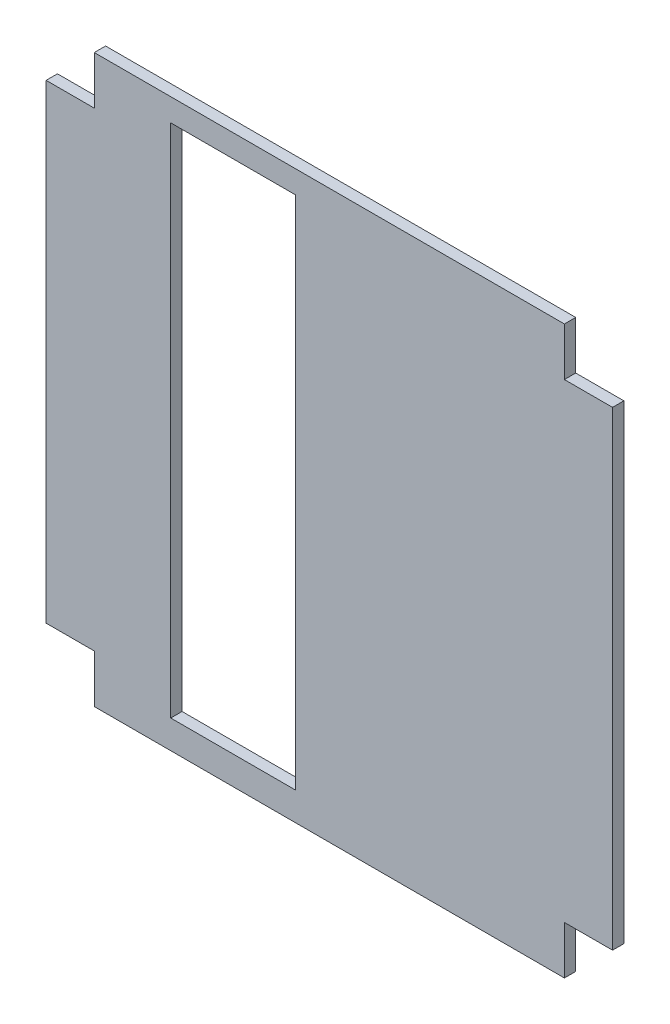
ISO-10303-21;
HEADER;
FILE_DESCRIPTION(('STEP AP214'),'2;1');
FILE_NAME('part.step','',(''),(''),'','','');
FILE_SCHEMA(('AUTOMOTIVE_DESIGN { 1 0 10303 214 1 1 1 1 }'));
ENDSEC;
DATA;
#1=APPLICATION_CONTEXT('core data for automotive mechanical design processes');
#2=APPLICATION_PROTOCOL_DEFINITION('international standard','automotive_design',2000,#1);
#3=PRODUCT_CONTEXT('',#1,'mechanical');
#4=PRODUCT('Part','Part','',(#3));
#5=PRODUCT_RELATED_PRODUCT_CATEGORY('part','',(#4));
#6=PRODUCT_DEFINITION_FORMATION('','',#4);
#7=PRODUCT_DEFINITION_CONTEXT('part definition',#1,'design');
#8=PRODUCT_DEFINITION('design','',#6,#7);
#9=PRODUCT_DEFINITION_SHAPE('','',#8);
#10=(LENGTH_UNIT() NAMED_UNIT(*) SI_UNIT(.MILLI.,.METRE.));
#11=(NAMED_UNIT(*) PLANE_ANGLE_UNIT() SI_UNIT($,.RADIAN.));
#12=(NAMED_UNIT(*) SI_UNIT($,.STERADIAN.) SOLID_ANGLE_UNIT());
#13=UNCERTAINTY_MEASURE_WITH_UNIT(LENGTH_MEASURE(1.E-05),#10,'distance_accuracy_value','');
#14=(GEOMETRIC_REPRESENTATION_CONTEXT(3) GLOBAL_UNCERTAINTY_ASSIGNED_CONTEXT((#13)) GLOBAL_UNIT_ASSIGNED_CONTEXT((#10,
#11,#12)) REPRESENTATION_CONTEXT('',''));
#15=CARTESIAN_POINT('',(0.,0.,0.));
#16=DIRECTION('',(0.,0.,1.));
#17=DIRECTION('',(1.,0.,0.));
#18=AXIS2_PLACEMENT_3D('',#15,#16,#17);
#19=CARTESIAN_POINT('',(0.,0.,2.));
#20=DIRECTION('',(0.,0.,1.));
#21=DIRECTION('',(1.,0.,0.));
#22=AXIS2_PLACEMENT_3D('',#19,#20,#21);
#23=PLANE('',#22);
#24=DIRECTION('',(1.,0.,0.));
#25=VECTOR('',#24,1.);
#26=CARTESIAN_POINT('',(-99.,90.5,2.));
#27=LINE('',#26,#25);
#28=CARTESIAN_POINT('',(-99.,90.5,2.));
#29=VERTEX_POINT('',#28);
#30=CARTESIAN_POINT('',(-90.5,90.5,2.));
#31=VERTEX_POINT('',#30);
#32=EDGE_CURVE('E187',#29,#31,#27,.T.);
#33=ORIENTED_EDGE('',*,*,#32,.F.);
#34=DIRECTION('',(0.,-1.,0.));
#35=VECTOR('',#34,1.);
#36=CARTESIAN_POINT('',(-99.,90.5,2.));
#37=LINE('',#36,#35);
#38=CARTESIAN_POINT('',(-99.,7.5,2.));
#39=VERTEX_POINT('',#38);
#40=EDGE_CURVE('E219',#29,#39,#37,.T.);
#41=ORIENTED_EDGE('',*,*,#40,.T.);
#42=DIRECTION('',(-1.,0.,0.));
#43=VECTOR('',#42,1.);
#44=CARTESIAN_POINT('',(-90.5,7.5,2.));
#45=LINE('',#44,#43);
#46=CARTESIAN_POINT('',(-90.5,7.5,2.));
#47=VERTEX_POINT('',#46);
#48=EDGE_CURVE('E216',#47,#39,#45,.T.);
#49=ORIENTED_EDGE('',*,*,#48,.F.);
#50=DIRECTION('',(0.,1.,0.));
#51=VECTOR('',#50,1.);
#52=CARTESIAN_POINT('',(-90.5,-1.,2.));
#53=LINE('',#52,#51);
#54=CARTESIAN_POINT('',(-90.5,-1.,2.));
#55=VERTEX_POINT('',#54);
#56=EDGE_CURVE('E213',#55,#47,#53,.T.);
#57=ORIENTED_EDGE('',*,*,#56,.F.);
#58=DIRECTION('',(1.,0.,0.));
#59=VECTOR('',#58,1.);
#60=CARTESIAN_POINT('',(-90.5,-1.,2.));
#61=LINE('',#60,#59);
#62=CARTESIAN_POINT('',(-7.49999999999998,-1.,2.));
#63=VERTEX_POINT('',#62);
#64=EDGE_CURVE('E211',#55,#63,#61,.T.);
#65=ORIENTED_EDGE('',*,*,#64,.T.);
#66=DIRECTION('',(0.,-1.,0.));
#67=VECTOR('',#66,1.);
#68=CARTESIAN_POINT('',(-7.49999999999999,7.5,2.));
#69=LINE('',#68,#67);
#70=CARTESIAN_POINT('',(-7.49999999999999,7.5,2.));
#71=VERTEX_POINT('',#70);
#72=EDGE_CURVE('E208',#71,#63,#69,.T.);
#73=ORIENTED_EDGE('',*,*,#72,.F.);
#74=DIRECTION('',(-1.,0.,0.));
#75=VECTOR('',#74,1.);
#76=CARTESIAN_POINT('',(1.00000000000001,7.5,2.));
#77=LINE('',#76,#75);
#78=CARTESIAN_POINT('',(1.00000000000001,7.5,2.));
#79=VERTEX_POINT('',#78);
#80=EDGE_CURVE('E205',#79,#71,#77,.T.);
#81=ORIENTED_EDGE('',*,*,#80,.F.);
#82=DIRECTION('',(0.,-1.,0.));
#83=VECTOR('',#82,1.);
#84=CARTESIAN_POINT('',(0.999999999999946,90.4999999999999,2.));
#85=LINE('',#84,#83);
#86=CARTESIAN_POINT('',(0.999999999999946,90.4999999999999,2.));
#87=VERTEX_POINT('',#86);
#88=EDGE_CURVE('E202',#87,#79,#85,.T.);
#89=ORIENTED_EDGE('',*,*,#88,.F.);
#90=DIRECTION('',(1.,0.,0.));
#91=VECTOR('',#90,1.);
#92=CARTESIAN_POINT('',(-7.50000000000006,90.4999999999999,2.));
#93=LINE('',#92,#91);
#94=CARTESIAN_POINT('',(-7.50000000000006,90.4999999999999,2.));
#95=VERTEX_POINT('',#94);
#96=EDGE_CURVE('E199',#95,#87,#93,.T.);
#97=ORIENTED_EDGE('',*,*,#96,.F.);
#98=DIRECTION('',(0.,-1.,0.));
#99=VECTOR('',#98,1.);
#100=CARTESIAN_POINT('',(-7.50000000000005,98.9999999999999,2.));
#101=LINE('',#100,#99);
#102=CARTESIAN_POINT('',(-7.50000000000005,98.9999999999999,2.));
#103=VERTEX_POINT('',#102);
#104=EDGE_CURVE('E196',#103,#95,#101,.T.);
#105=ORIENTED_EDGE('',*,*,#104,.F.);
#106=DIRECTION('',(-1.,0.,0.));
#107=VECTOR('',#106,1.);
#108=CARTESIAN_POINT('',(-7.50000000000005,98.9999999999999,2.));
#109=LINE('',#108,#107);
#110=CARTESIAN_POINT('',(-90.5,99.,2.));
#111=VERTEX_POINT('',#110);
#112=EDGE_CURVE('E194',#103,#111,#109,.T.);
#113=ORIENTED_EDGE('',*,*,#112,.T.);
#114=DIRECTION('',(0.,1.,0.));
#115=VECTOR('',#114,1.);
#116=CARTESIAN_POINT('',(-90.5,90.5,2.));
#117=LINE('',#116,#115);
#118=EDGE_CURVE('E190',#31,#111,#117,.T.);
#119=ORIENTED_EDGE('',*,*,#118,.F.);
#120=EDGE_LOOP('',(#33,#41,#49,#57,#65,#73,#81,#89,#97,#105,#113,#119));
#121=FACE_BOUND('',#120,.T.);
#122=DIRECTION('',(0.,1.,0.));
#123=VECTOR('',#122,1.);
#124=CARTESIAN_POINT('',(-55.,3.99999999999999,2.));
#125=LINE('',#124,#123);
#126=CARTESIAN_POINT('',(-55.,3.99999999999999,2.));
#127=VERTEX_POINT('',#126);
#128=CARTESIAN_POINT('',(-55.,95.,2.));
#129=VERTEX_POINT('',#128);
#130=EDGE_CURVE('E159',#127,#129,#125,.T.);
#131=ORIENTED_EDGE('',*,*,#130,.F.);
#132=DIRECTION('',(1.,0.,0.));
#133=VECTOR('',#132,1.);
#134=CARTESIAN_POINT('',(-77.,4.,2.));
#135=LINE('',#134,#133);
#136=CARTESIAN_POINT('',(-77.,4.,2.));
#137=VERTEX_POINT('',#136);
#138=EDGE_CURVE('E151',#137,#127,#135,.T.);
#139=ORIENTED_EDGE('',*,*,#138,.F.);
#140=DIRECTION('',(0.,-1.,0.));
#141=VECTOR('',#140,1.);
#142=CARTESIAN_POINT('',(-77.,95.,2.));
#143=LINE('',#142,#141);
#144=CARTESIAN_POINT('',(-77.,95.,2.));
#145=VERTEX_POINT('',#144);
#146=EDGE_CURVE('E173',#145,#137,#143,.T.);
#147=ORIENTED_EDGE('',*,*,#146,.F.);
#148=DIRECTION('',(-1.,0.,0.));
#149=VECTOR('',#148,1.);
#150=CARTESIAN_POINT('',(-55.,95.,2.));
#151=LINE('',#150,#149);
#152=EDGE_CURVE('E171',#129,#145,#151,.T.);
#153=ORIENTED_EDGE('',*,*,#152,.F.);
#154=EDGE_LOOP('',(#131,#139,#147,#153));
#155=FACE_BOUND('',#154,.T.);
#156=ADVANCED_FACE('F37',(#121,#155),#23,.T.);
#157=CARTESIAN_POINT('',(0.,0.,0.));
#158=DIRECTION('',(0.,0.,1.));
#159=DIRECTION('',(1.,0.,0.));
#160=AXIS2_PLACEMENT_3D('',#157,#158,#159);
#161=PLANE('',#160);
#162=DIRECTION('',(1.,0.,0.));
#163=VECTOR('',#162,1.);
#164=CARTESIAN_POINT('',(-99.,90.5,0.));
#165=LINE('',#164,#163);
#166=CARTESIAN_POINT('',(-99.,90.5,0.));
#167=VERTEX_POINT('',#166);
#168=CARTESIAN_POINT('',(-90.5,90.5,0.));
#169=VERTEX_POINT('',#168);
#170=EDGE_CURVE('E167',#167,#169,#165,.T.);
#171=ORIENTED_EDGE('',*,*,#170,.T.);
#172=DIRECTION('',(0.,1.,0.));
#173=VECTOR('',#172,1.);
#174=CARTESIAN_POINT('',(-90.5,90.5,0.));
#175=LINE('',#174,#173);
#176=CARTESIAN_POINT('',(-90.5,99.,0.));
#177=VERTEX_POINT('',#176);
#178=EDGE_CURVE('E223',#169,#177,#175,.T.);
#179=ORIENTED_EDGE('',*,*,#178,.T.);
#180=DIRECTION('',(-1.,0.,0.));
#181=VECTOR('',#180,1.);
#182=CARTESIAN_POINT('',(-7.50000000000005,98.9999999999999,0.));
#183=LINE('',#182,#181);
#184=CARTESIAN_POINT('',(-7.50000000000005,98.9999999999999,0.));
#185=VERTEX_POINT('',#184);
#186=EDGE_CURVE('E226',#185,#177,#183,.T.);
#187=ORIENTED_EDGE('',*,*,#186,.F.);
#188=DIRECTION('',(0.,-1.,0.));
#189=VECTOR('',#188,1.);
#190=CARTESIAN_POINT('',(-7.50000000000005,98.9999999999999,0.));
#191=LINE('',#190,#189);
#192=CARTESIAN_POINT('',(-7.50000000000006,90.4999999999999,0.));
#193=VERTEX_POINT('',#192);
#194=EDGE_CURVE('E229',#185,#193,#191,.T.);
#195=ORIENTED_EDGE('',*,*,#194,.T.);
#196=DIRECTION('',(1.,0.,0.));
#197=VECTOR('',#196,1.);
#198=CARTESIAN_POINT('',(-7.50000000000006,90.4999999999999,0.));
#199=LINE('',#198,#197);
#200=CARTESIAN_POINT('',(0.999999999999946,90.4999999999999,0.));
#201=VERTEX_POINT('',#200);
#202=EDGE_CURVE('E232',#193,#201,#199,.T.);
#203=ORIENTED_EDGE('',*,*,#202,.T.);
#204=DIRECTION('',(0.,-1.,0.));
#205=VECTOR('',#204,1.);
#206=CARTESIAN_POINT('',(0.999999999999946,90.4999999999999,0.));
#207=LINE('',#206,#205);
#208=CARTESIAN_POINT('',(1.00000000000001,7.5,0.));
#209=VERTEX_POINT('',#208);
#210=EDGE_CURVE('E235',#201,#209,#207,.T.);
#211=ORIENTED_EDGE('',*,*,#210,.T.);
#212=DIRECTION('',(-1.,0.,0.));
#213=VECTOR('',#212,1.);
#214=CARTESIAN_POINT('',(1.00000000000001,7.5,0.));
#215=LINE('',#214,#213);
#216=CARTESIAN_POINT('',(-7.49999999999999,7.5,0.));
#217=VERTEX_POINT('',#216);
#218=EDGE_CURVE('E238',#209,#217,#215,.T.);
#219=ORIENTED_EDGE('',*,*,#218,.T.);
#220=DIRECTION('',(0.,-1.,0.));
#221=VECTOR('',#220,1.);
#222=CARTESIAN_POINT('',(-7.49999999999999,7.5,0.));
#223=LINE('',#222,#221);
#224=CARTESIAN_POINT('',(-7.49999999999998,-1.,0.));
#225=VERTEX_POINT('',#224);
#226=EDGE_CURVE('E241',#217,#225,#223,.T.);
#227=ORIENTED_EDGE('',*,*,#226,.T.);
#228=DIRECTION('',(1.,0.,0.));
#229=VECTOR('',#228,1.);
#230=CARTESIAN_POINT('',(-90.5,-1.,0.));
#231=LINE('',#230,#229);
#232=CARTESIAN_POINT('',(-90.5,-1.,0.));
#233=VERTEX_POINT('',#232);
#234=EDGE_CURVE('E244',#233,#225,#231,.T.);
#235=ORIENTED_EDGE('',*,*,#234,.F.);
#236=DIRECTION('',(0.,1.,0.));
#237=VECTOR('',#236,1.);
#238=CARTESIAN_POINT('',(-90.5,-1.,0.));
#239=LINE('',#238,#237);
#240=CARTESIAN_POINT('',(-90.5,7.5,0.));
#241=VERTEX_POINT('',#240);
#242=EDGE_CURVE('E247',#233,#241,#239,.T.);
#243=ORIENTED_EDGE('',*,*,#242,.T.);
#244=DIRECTION('',(-1.,0.,0.));
#245=VECTOR('',#244,1.);
#246=CARTESIAN_POINT('',(-90.5,7.5,0.));
#247=LINE('',#246,#245);
#248=CARTESIAN_POINT('',(-99.,7.5,0.));
#249=VERTEX_POINT('',#248);
#250=EDGE_CURVE('E250',#241,#249,#247,.T.);
#251=ORIENTED_EDGE('',*,*,#250,.T.);
#252=DIRECTION('',(0.,-1.,0.));
#253=VECTOR('',#252,1.);
#254=CARTESIAN_POINT('',(-99.,90.5,0.));
#255=LINE('',#254,#253);
#256=EDGE_CURVE('E191',#167,#249,#255,.T.);
#257=ORIENTED_EDGE('',*,*,#256,.F.);
#258=EDGE_LOOP('',(#171,#179,#187,#195,#203,#211,#219,#227,#235,#243,#251,#257));
#259=FACE_BOUND('',#258,.T.);
#260=DIRECTION('',(1.,0.,0.));
#261=VECTOR('',#260,1.);
#262=CARTESIAN_POINT('',(-77.,4.,0.));
#263=LINE('',#262,#261);
#264=CARTESIAN_POINT('',(-77.,4.,0.));
#265=VERTEX_POINT('',#264);
#266=CARTESIAN_POINT('',(-55.,3.99999999999999,0.));
#267=VERTEX_POINT('',#266);
#268=EDGE_CURVE('E62',#265,#267,#263,.T.);
#269=ORIENTED_EDGE('',*,*,#268,.T.);
#270=DIRECTION('',(0.,1.,0.));
#271=VECTOR('',#270,1.);
#272=CARTESIAN_POINT('',(-55.,3.99999999999999,0.));
#273=LINE('',#272,#271);
#274=CARTESIAN_POINT('',(-55.,95.,0.));
#275=VERTEX_POINT('',#274);
#276=EDGE_CURVE('E166',#267,#275,#273,.T.);
#277=ORIENTED_EDGE('',*,*,#276,.T.);
#278=DIRECTION('',(-1.,0.,0.));
#279=VECTOR('',#278,1.);
#280=CARTESIAN_POINT('',(-55.,95.,0.));
#281=LINE('',#280,#279);
#282=CARTESIAN_POINT('',(-77.,95.,0.));
#283=VERTEX_POINT('',#282);
#284=EDGE_CURVE('E179',#275,#283,#281,.T.);
#285=ORIENTED_EDGE('',*,*,#284,.T.);
#286=DIRECTION('',(0.,-1.,0.));
#287=VECTOR('',#286,1.);
#288=CARTESIAN_POINT('',(-77.,95.,0.));
#289=LINE('',#288,#287);
#290=EDGE_CURVE('E160',#283,#265,#289,.T.);
#291=ORIENTED_EDGE('',*,*,#290,.T.);
#292=EDGE_LOOP('',(#269,#277,#285,#291));
#293=FACE_BOUND('',#292,.T.);
#294=ADVANCED_FACE('F283',(#259,#293),#161,.F.);
#295=CARTESIAN_POINT('',(-99.,90.5,2.));
#296=DIRECTION('',(0.,1.,0.));
#297=DIRECTION('',(0.,0.,1.));
#298=AXIS2_PLACEMENT_3D('',#295,#296,#297);
#299=PLANE('',#298);
#300=ORIENTED_EDGE('',*,*,#170,.F.);
#301=DIRECTION('',(0.,0.,-1.));
#302=VECTOR('',#301,1.);
#303=CARTESIAN_POINT('',(-99.,90.5,2.));
#304=LINE('',#303,#302);
#305=EDGE_CURVE('E11',#29,#167,#304,.T.);
#306=ORIENTED_EDGE('',*,*,#305,.F.);
#307=ORIENTED_EDGE('',*,*,#32,.T.);
#308=DIRECTION('',(0.,0.,-1.));
#309=VECTOR('',#308,1.);
#310=CARTESIAN_POINT('',(-90.5,90.5,2.));
#311=LINE('',#310,#309);
#312=EDGE_CURVE('E41',#31,#169,#311,.T.);
#313=ORIENTED_EDGE('',*,*,#312,.T.);
#314=EDGE_LOOP('',(#300,#306,#307,#313));
#315=FACE_BOUND('',#314,.T.);
#316=ADVANCED_FACE('F39',(#315),#299,.T.);
#317=CARTESIAN_POINT('',(-99.,90.5,2.));
#318=DIRECTION('',(1.,0.,0.));
#319=DIRECTION('',(0.,1.,0.));
#320=AXIS2_PLACEMENT_3D('',#317,#318,#319);
#321=PLANE('',#320);
#322=ORIENTED_EDGE('',*,*,#256,.T.);
#323=DIRECTION('',(0.,0.,-1.));
#324=VECTOR('',#323,1.);
#325=CARTESIAN_POINT('',(-99.,7.5,2.));
#326=LINE('',#325,#324);
#327=EDGE_CURVE('E46',#39,#249,#326,.T.);
#328=ORIENTED_EDGE('',*,*,#327,.F.);
#329=ORIENTED_EDGE('',*,*,#40,.F.);
#330=ORIENTED_EDGE('',*,*,#305,.T.);
#331=EDGE_LOOP('',(#322,#328,#329,#330));
#332=FACE_BOUND('',#331,.T.);
#333=ADVANCED_FACE('F288',(#332),#321,.F.);
#334=CARTESIAN_POINT('',(-90.5,7.5,2.));
#335=DIRECTION('',(0.,-1.,0.));
#336=DIRECTION('',(0.,0.,-1.));
#337=AXIS2_PLACEMENT_3D('',#334,#335,#336);
#338=PLANE('',#337);
#339=ORIENTED_EDGE('',*,*,#250,.F.);
#340=DIRECTION('',(0.,0.,-1.));
#341=VECTOR('',#340,1.);
#342=CARTESIAN_POINT('',(-90.5,7.5,2.));
#343=LINE('',#342,#341);
#344=EDGE_CURVE('E256',#47,#241,#343,.T.);
#345=ORIENTED_EDGE('',*,*,#344,.F.);
#346=ORIENTED_EDGE('',*,*,#48,.T.);
#347=ORIENTED_EDGE('',*,*,#327,.T.);
#348=EDGE_LOOP('',(#339,#345,#346,#347));
#349=FACE_BOUND('',#348,.T.);
#350=ADVANCED_FACE('F324',(#349),#338,.T.);
#351=CARTESIAN_POINT('',(-90.5,-1.,2.));
#352=DIRECTION('',(-1.,0.,0.));
#353=DIRECTION('',(0.,0.,1.));
#354=AXIS2_PLACEMENT_3D('',#351,#352,#353);
#355=PLANE('',#354);
#356=ORIENTED_EDGE('',*,*,#242,.F.);
#357=DIRECTION('',(0.,0.,-1.));
#358=VECTOR('',#357,1.);
#359=CARTESIAN_POINT('',(-90.5,-1.,2.));
#360=LINE('',#359,#358);
#361=EDGE_CURVE('E258',#55,#233,#360,.T.);
#362=ORIENTED_EDGE('',*,*,#361,.F.);
#363=ORIENTED_EDGE('',*,*,#56,.T.);
#364=ORIENTED_EDGE('',*,*,#344,.T.);
#365=EDGE_LOOP('',(#356,#362,#363,#364));
#366=FACE_BOUND('',#365,.T.);
#367=ADVANCED_FACE('F320',(#366),#355,.T.);
#368=CARTESIAN_POINT('',(-90.5,-1.,2.));
#369=DIRECTION('',(0.,1.,0.));
#370=DIRECTION('',(-1.,0.,0.));
#371=AXIS2_PLACEMENT_3D('',#368,#369,#370);
#372=PLANE('',#371);
#373=ORIENTED_EDGE('',*,*,#234,.T.);
#374=DIRECTION('',(0.,0.,-1.));
#375=VECTOR('',#374,1.);
#376=CARTESIAN_POINT('',(-7.49999999999998,-1.,2.));
#377=LINE('',#376,#375);
#378=EDGE_CURVE('E260',#63,#225,#377,.T.);
#379=ORIENTED_EDGE('',*,*,#378,.F.);
#380=ORIENTED_EDGE('',*,*,#64,.F.);
#381=ORIENTED_EDGE('',*,*,#361,.T.);
#382=EDGE_LOOP('',(#373,#379,#380,#381));
#383=FACE_BOUND('',#382,.T.);
#384=ADVANCED_FACE('F325',(#383),#372,.F.);
#385=CARTESIAN_POINT('',(-7.49999999999999,7.5,2.));
#386=DIRECTION('',(1.,0.,0.));
#387=DIRECTION('',(0.,1.,0.));
#388=AXIS2_PLACEMENT_3D('',#385,#386,#387);
#389=PLANE('',#388);
#390=ORIENTED_EDGE('',*,*,#226,.F.);
#391=DIRECTION('',(0.,0.,-1.));
#392=VECTOR('',#391,1.);
#393=CARTESIAN_POINT('',(-7.49999999999999,7.5,2.));
#394=LINE('',#393,#392);
#395=EDGE_CURVE('E262',#71,#217,#394,.T.);
#396=ORIENTED_EDGE('',*,*,#395,.F.);
#397=ORIENTED_EDGE('',*,*,#72,.T.);
#398=ORIENTED_EDGE('',*,*,#378,.T.);
#399=EDGE_LOOP('',(#390,#396,#397,#398));
#400=FACE_BOUND('',#399,.T.);
#401=ADVANCED_FACE('F314',(#400),#389,.T.);
#402=CARTESIAN_POINT('',(1.00000000000001,7.5,2.));
#403=DIRECTION('',(0.,-1.,0.));
#404=DIRECTION('',(1.,0.,0.));
#405=AXIS2_PLACEMENT_3D('',#402,#403,#404);
#406=PLANE('',#405);
#407=ORIENTED_EDGE('',*,*,#218,.F.);
#408=DIRECTION('',(0.,0.,-1.));
#409=VECTOR('',#408,1.);
#410=CARTESIAN_POINT('',(1.00000000000001,7.5,2.));
#411=LINE('',#410,#409);
#412=EDGE_CURVE('E264',#79,#209,#411,.T.);
#413=ORIENTED_EDGE('',*,*,#412,.F.);
#414=ORIENTED_EDGE('',*,*,#80,.T.);
#415=ORIENTED_EDGE('',*,*,#395,.T.);
#416=EDGE_LOOP('',(#407,#413,#414,#415));
#417=FACE_BOUND('',#416,.T.);
#418=ADVANCED_FACE('F310',(#417),#406,.T.);
#419=CARTESIAN_POINT('',(0.999999999999946,90.4999999999999,2.));
#420=DIRECTION('',(1.,0.,0.));
#421=DIRECTION('',(0.,1.,0.));
#422=AXIS2_PLACEMENT_3D('',#419,#420,#421);
#423=PLANE('',#422);
#424=ORIENTED_EDGE('',*,*,#210,.F.);
#425=DIRECTION('',(0.,0.,-1.));
#426=VECTOR('',#425,1.);
#427=CARTESIAN_POINT('',(0.999999999999946,90.4999999999999,2.));
#428=LINE('',#427,#426);
#429=EDGE_CURVE('E266',#87,#201,#428,.T.);
#430=ORIENTED_EDGE('',*,*,#429,.F.);
#431=ORIENTED_EDGE('',*,*,#88,.T.);
#432=ORIENTED_EDGE('',*,*,#412,.T.);
#433=EDGE_LOOP('',(#424,#430,#431,#432));
#434=FACE_BOUND('',#433,.T.);
#435=ADVANCED_FACE('F306',(#434),#423,.T.);
#436=CARTESIAN_POINT('',(-7.50000000000006,90.4999999999999,2.));
#437=DIRECTION('',(0.,1.,0.));
#438=DIRECTION('',(0.,0.,1.));
#439=AXIS2_PLACEMENT_3D('',#436,#437,#438);
#440=PLANE('',#439);
#441=ORIENTED_EDGE('',*,*,#202,.F.);
#442=DIRECTION('',(0.,0.,-1.));
#443=VECTOR('',#442,1.);
#444=CARTESIAN_POINT('',(-7.50000000000006,90.4999999999999,2.));
#445=LINE('',#444,#443);
#446=EDGE_CURVE('E268',#95,#193,#445,.T.);
#447=ORIENTED_EDGE('',*,*,#446,.F.);
#448=ORIENTED_EDGE('',*,*,#96,.T.);
#449=ORIENTED_EDGE('',*,*,#429,.T.);
#450=EDGE_LOOP('',(#441,#447,#448,#449));
#451=FACE_BOUND('',#450,.T.);
#452=ADVANCED_FACE('F302',(#451),#440,.T.);
#453=CARTESIAN_POINT('',(-7.50000000000005,98.9999999999999,2.));
#454=DIRECTION('',(1.,0.,0.));
#455=DIRECTION('',(0.,1.,0.));
#456=AXIS2_PLACEMENT_3D('',#453,#454,#455);
#457=PLANE('',#456);
#458=ORIENTED_EDGE('',*,*,#194,.F.);
#459=DIRECTION('',(0.,0.,-1.));
#460=VECTOR('',#459,1.);
#461=CARTESIAN_POINT('',(-7.50000000000005,98.9999999999999,2.));
#462=LINE('',#461,#460);
#463=EDGE_CURVE('E270',#103,#185,#462,.T.);
#464=ORIENTED_EDGE('',*,*,#463,.F.);
#465=ORIENTED_EDGE('',*,*,#104,.T.);
#466=ORIENTED_EDGE('',*,*,#446,.T.);
#467=EDGE_LOOP('',(#458,#464,#465,#466));
#468=FACE_BOUND('',#467,.T.);
#469=ADVANCED_FACE('F299',(#468),#457,.T.);
#470=CARTESIAN_POINT('',(-7.50000000000005,98.9999999999999,2.));
#471=DIRECTION('',(0.,-1.,0.));
#472=DIRECTION('',(1.,0.,0.));
#473=AXIS2_PLACEMENT_3D('',#470,#471,#472);
#474=PLANE('',#473);
#475=ORIENTED_EDGE('',*,*,#186,.T.);
#476=DIRECTION('',(0.,0.,-1.));
#477=VECTOR('',#476,1.);
#478=CARTESIAN_POINT('',(-90.5,99.,2.));
#479=LINE('',#478,#477);
#480=EDGE_CURVE('E271',#111,#177,#479,.T.);
#481=ORIENTED_EDGE('',*,*,#480,.F.);
#482=ORIENTED_EDGE('',*,*,#112,.F.);
#483=ORIENTED_EDGE('',*,*,#463,.T.);
#484=EDGE_LOOP('',(#475,#481,#482,#483));
#485=FACE_BOUND('',#484,.T.);
#486=ADVANCED_FACE('F296',(#485),#474,.F.);
#487=CARTESIAN_POINT('',(-90.5,90.5,2.));
#488=DIRECTION('',(-1.,0.,0.));
#489=DIRECTION('',(0.,-1.,0.));
#490=AXIS2_PLACEMENT_3D('',#487,#488,#489);
#491=PLANE('',#490);
#492=ORIENTED_EDGE('',*,*,#178,.F.);
#493=ORIENTED_EDGE('',*,*,#312,.F.);
#494=ORIENTED_EDGE('',*,*,#118,.T.);
#495=ORIENTED_EDGE('',*,*,#480,.T.);
#496=EDGE_LOOP('',(#492,#493,#494,#495));
#497=FACE_BOUND('',#496,.T.);
#498=ADVANCED_FACE('F279',(#497),#491,.T.);
#499=CARTESIAN_POINT('',(-77.,4.,2.));
#500=DIRECTION('',(0.,1.,0.));
#501=DIRECTION('',(-1.,0.,0.));
#502=AXIS2_PLACEMENT_3D('',#499,#500,#501);
#503=PLANE('',#502);
#504=ORIENTED_EDGE('',*,*,#268,.F.);
#505=DIRECTION('',(0.,0.,-1.));
#506=VECTOR('',#505,1.);
#507=CARTESIAN_POINT('',(-77.,4.,2.));
#508=LINE('',#507,#506);
#509=EDGE_CURVE('E155',#137,#265,#508,.T.);
#510=ORIENTED_EDGE('',*,*,#509,.F.);
#511=ORIENTED_EDGE('',*,*,#138,.T.);
#512=DIRECTION('',(0.,0.,-1.));
#513=VECTOR('',#512,1.);
#514=CARTESIAN_POINT('',(-55.,3.99999999999999,2.));
#515=LINE('',#514,#513);
#516=EDGE_CURVE('E154',#127,#267,#515,.T.);
#517=ORIENTED_EDGE('',*,*,#516,.T.);
#518=EDGE_LOOP('',(#504,#510,#511,#517));
#519=FACE_BOUND('',#518,.T.);
#520=ADVANCED_FACE('F153',(#519),#503,.T.);
#521=CARTESIAN_POINT('',(-55.,3.99999999999999,2.));
#522=DIRECTION('',(-1.,0.,0.));
#523=DIRECTION('',(0.,-1.,0.));
#524=AXIS2_PLACEMENT_3D('',#521,#522,#523);
#525=PLANE('',#524);
#526=ORIENTED_EDGE('',*,*,#276,.F.);
#527=ORIENTED_EDGE('',*,*,#516,.F.);
#528=ORIENTED_EDGE('',*,*,#130,.T.);
#529=DIRECTION('',(0.,0.,-1.));
#530=VECTOR('',#529,1.);
#531=CARTESIAN_POINT('',(-55.,95.,2.));
#532=LINE('',#531,#530);
#533=EDGE_CURVE('E168',#129,#275,#532,.T.);
#534=ORIENTED_EDGE('',*,*,#533,.T.);
#535=EDGE_LOOP('',(#526,#527,#528,#534));
#536=FACE_BOUND('',#535,.T.);
#537=ADVANCED_FACE('F163',(#536),#525,.T.);
#538=CARTESIAN_POINT('',(-55.,95.,2.));
#539=DIRECTION('',(0.,-1.,0.));
#540=DIRECTION('',(0.,0.,-1.));
#541=AXIS2_PLACEMENT_3D('',#538,#539,#540);
#542=PLANE('',#541);
#543=ORIENTED_EDGE('',*,*,#284,.F.);
#544=ORIENTED_EDGE('',*,*,#533,.F.);
#545=ORIENTED_EDGE('',*,*,#152,.T.);
#546=DIRECTION('',(0.,0.,-1.));
#547=VECTOR('',#546,1.);
#548=CARTESIAN_POINT('',(-77.,95.,2.));
#549=LINE('',#548,#547);
#550=EDGE_CURVE('E54',#145,#283,#549,.T.);
#551=ORIENTED_EDGE('',*,*,#550,.T.);
#552=EDGE_LOOP('',(#543,#544,#545,#551));
#553=FACE_BOUND('',#552,.T.);
#554=ADVANCED_FACE('F438',(#553),#542,.T.);
#555=CARTESIAN_POINT('',(-77.,95.,2.));
#556=DIRECTION('',(1.,0.,0.));
#557=DIRECTION('',(0.,1.,0.));
#558=AXIS2_PLACEMENT_3D('',#555,#556,#557);
#559=PLANE('',#558);
#560=ORIENTED_EDGE('',*,*,#290,.F.);
#561=ORIENTED_EDGE('',*,*,#550,.F.);
#562=ORIENTED_EDGE('',*,*,#146,.T.);
#563=ORIENTED_EDGE('',*,*,#509,.T.);
#564=EDGE_LOOP('',(#560,#561,#562,#563));
#565=FACE_BOUND('',#564,.T.);
#566=ADVANCED_FACE('F446',(#565),#559,.T.);
#567=CLOSED_SHELL('',(#156,#294,#316,#333,#350,#367,#384,#401,#418,#435,#452,#469,#486,#498,
#520,#537,#554,#566));
#568=MANIFOLD_SOLID_BREP('B2',#567);
#569=ADVANCED_BREP_SHAPE_REPRESENTATION('',(#18,#568),#14);
#570=SHAPE_DEFINITION_REPRESENTATION(#9,#569);
ENDSEC;
END-ISO-10303-21;
